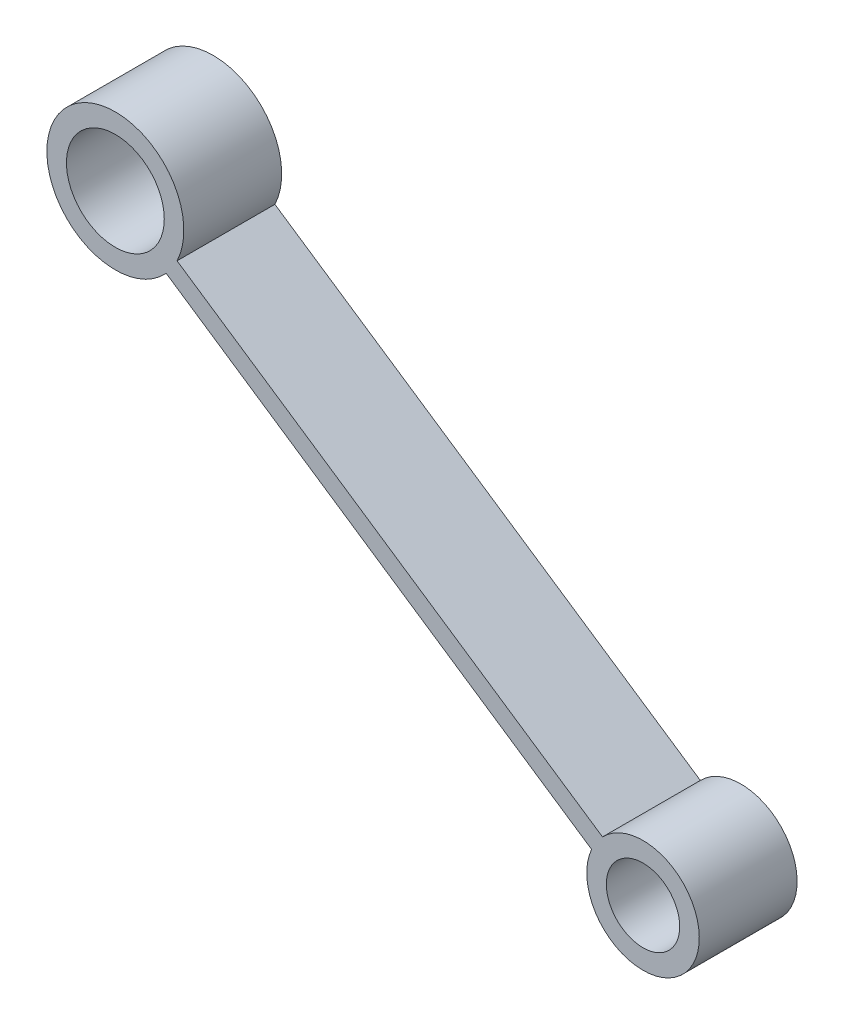
ISO-10303-21;
HEADER;
FILE_DESCRIPTION(('STEP AP214'),'2;1');
FILE_NAME('part.step','',(''),(''),'','','');
FILE_SCHEMA(('AUTOMOTIVE_DESIGN { 1 0 10303 214 1 1 1 1 }'));
ENDSEC;
DATA;
#1=APPLICATION_CONTEXT('core data for automotive mechanical design processes');
#2=APPLICATION_PROTOCOL_DEFINITION('international standard','automotive_design',2000,#1);
#3=PRODUCT_CONTEXT('',#1,'mechanical');
#4=PRODUCT('Part','Part','',(#3));
#5=PRODUCT_RELATED_PRODUCT_CATEGORY('part','',(#4));
#6=PRODUCT_DEFINITION_FORMATION('','',#4);
#7=PRODUCT_DEFINITION_CONTEXT('part definition',#1,'design');
#8=PRODUCT_DEFINITION('design','',#6,#7);
#9=PRODUCT_DEFINITION_SHAPE('','',#8);
#10=(LENGTH_UNIT() NAMED_UNIT(*) SI_UNIT(.MILLI.,.METRE.));
#11=(NAMED_UNIT(*) PLANE_ANGLE_UNIT() SI_UNIT($,.RADIAN.));
#12=(NAMED_UNIT(*) SI_UNIT($,.STERADIAN.) SOLID_ANGLE_UNIT());
#13=UNCERTAINTY_MEASURE_WITH_UNIT(LENGTH_MEASURE(1.E-05),#10,'distance_accuracy_value','');
#14=(GEOMETRIC_REPRESENTATION_CONTEXT(3) GLOBAL_UNCERTAINTY_ASSIGNED_CONTEXT((#13)) GLOBAL_UNIT_ASSIGNED_CONTEXT((#10,
#11,#12)) REPRESENTATION_CONTEXT('',''));
#15=CARTESIAN_POINT('',(0.,0.,0.));
#16=DIRECTION('',(0.,0.,1.));
#17=DIRECTION('',(1.,0.,0.));
#18=AXIS2_PLACEMENT_3D('',#15,#16,#17);
#19=CARTESIAN_POINT('',(0.,0.,10.));
#20=DIRECTION('',(0.,0.,-1.));
#21=DIRECTION('',(-1.,0.,0.));
#22=AXIS2_PLACEMENT_3D('',#19,#20,#21);
#23=CYLINDRICAL_SURFACE('',#22,5.);
#24=CARTESIAN_POINT('',(0.,0.,0.));
#25=DIRECTION('',(0.,0.,1.));
#26=DIRECTION('',(1.,0.,0.));
#27=AXIS2_PLACEMENT_3D('',#24,#25,#26);
#28=CIRCLE('',#27,5.);
#29=CARTESIAN_POINT('',(5.,0.,0.));
#30=VERTEX_POINT('',#29);
#31=EDGE_CURVE('E103',#30,#30,#28,.T.);
#32=ORIENTED_EDGE('',*,*,#31,.F.);
#33=EDGE_LOOP('',(#32));
#34=FACE_BOUND('',#33,.T.);
#35=CARTESIAN_POINT('',(0.,0.,10.));
#36=DIRECTION('',(0.,0.,1.));
#37=DIRECTION('',(1.,0.,0.));
#38=AXIS2_PLACEMENT_3D('',#35,#36,#37);
#39=CIRCLE('',#38,5.);
#40=CARTESIAN_POINT('',(5.,0.,10.));
#41=VERTEX_POINT('',#40);
#42=EDGE_CURVE('E96',#41,#41,#39,.T.);
#43=ORIENTED_EDGE('',*,*,#42,.T.);
#44=EDGE_LOOP('',(#43));
#45=FACE_BOUND('',#44,.T.);
#46=ADVANCED_FACE('F33',(#34,#45),#23,.F.);
#47=CARTESIAN_POINT('',(3.50677804688463,-3.56405776186189,10.));
#48=DIRECTION('',(0.558138712554013,0.829747658959366,0.));
#49=DIRECTION('',(-0.829747658959366,0.558138712554013,0.));
#50=AXIS2_PLACEMENT_3D('',#47,#48,#49);
#51=PLANE('',#50);
#52=DIRECTION('',(0.829747658959366,-0.558138712554013,0.));
#53=VECTOR('',#52,1.);
#54=CARTESIAN_POINT('',(3.50677804688463,-3.56405776186189,0.));
#55=LINE('',#54,#53);
#56=CARTESIAN_POINT('',(5.19052169856181,-4.69664609021789,0.));
#57=VERTEX_POINT('',#56);
#58=CARTESIAN_POINT('',(48.6771160336573,-33.9483728211967,0.));
#59=VERTEX_POINT('',#58);
#60=EDGE_CURVE('E36',#57,#59,#55,.T.);
#61=ORIENTED_EDGE('',*,*,#60,.T.);
#62=DIRECTION('',(0.,0.,1.));
#63=VECTOR('',#62,1.);
#64=CARTESIAN_POINT('',(48.6771160336573,-33.9483728211967,0.));
#65=LINE('',#64,#63);
#66=CARTESIAN_POINT('',(48.6771160336573,-33.9483728211967,10.));
#67=VERTEX_POINT('',#66);
#68=EDGE_CURVE('E75',#59,#67,#65,.T.);
#69=ORIENTED_EDGE('',*,*,#68,.T.);
#70=DIRECTION('',(0.829747658959366,-0.558138712554013,0.));
#71=VECTOR('',#70,1.);
#72=CARTESIAN_POINT('',(3.50677804688463,-3.56405776186189,10.));
#73=LINE('',#72,#71);
#74=CARTESIAN_POINT('',(5.19052169856181,-4.69664609021789,10.));
#75=VERTEX_POINT('',#74);
#76=EDGE_CURVE('E11',#75,#67,#73,.T.);
#77=ORIENTED_EDGE('',*,*,#76,.F.);
#78=DIRECTION('',(0.,0.,1.));
#79=VECTOR('',#78,1.);
#80=CARTESIAN_POINT('',(5.19052169856181,-4.69664609021789,0.));
#81=LINE('',#80,#79);
#82=EDGE_CURVE('E95',#75,#57,#81,.F.);
#83=ORIENTED_EDGE('',*,*,#82,.T.);
#84=EDGE_LOOP('',(#61,#69,#77,#83));
#85=FACE_BOUND('',#84,.T.);
#86=ADVANCED_FACE('F93',(#85),#51,.F.);
#87=CARTESIAN_POINT('',(53.9335978323588,-36.2790163160108,10.));
#88=DIRECTION('',(0.,0.,-1.));
#89=DIRECTION('',(-1.,0.,0.));
#90=AXIS2_PLACEMENT_3D('',#87,#88,#89);
#91=CYLINDRICAL_SURFACE('',#90,3.75);
#92=CARTESIAN_POINT('',(53.9335978323588,-36.2790163160108,0.));
#93=DIRECTION('',(0.,0.,1.));
#94=DIRECTION('',(1.,0.,0.));
#95=AXIS2_PLACEMENT_3D('',#92,#93,#94);
#96=CIRCLE('',#95,3.75);
#97=CARTESIAN_POINT('',(57.6835978323588,-36.2790163160108,0.));
#98=VERTEX_POINT('',#97);
#99=EDGE_CURVE('E97',#98,#98,#96,.T.);
#100=ORIENTED_EDGE('',*,*,#99,.F.);
#101=EDGE_LOOP('',(#100));
#102=FACE_BOUND('',#101,.T.);
#103=CARTESIAN_POINT('',(53.9335978323588,-36.2790163160108,10.));
#104=DIRECTION('',(0.,0.,1.));
#105=DIRECTION('',(1.,0.,0.));
#106=AXIS2_PLACEMENT_3D('',#103,#104,#105);
#107=CIRCLE('',#106,3.75);
#108=CARTESIAN_POINT('',(57.6835978323588,-36.2790163160108,10.));
#109=VERTEX_POINT('',#108);
#110=EDGE_CURVE('E41',#109,#109,#107,.T.);
#111=ORIENTED_EDGE('',*,*,#110,.T.);
#112=EDGE_LOOP('',(#111));
#113=FACE_BOUND('',#112,.T.);
#114=ADVANCED_FACE('F126',(#102,#113),#91,.F.);
#115=CARTESIAN_POINT('',(4.62305547199266,-1.90456244394316,10.));
#116=DIRECTION('',(0.558138712554013,0.829747658959366,0.));
#117=DIRECTION('',(-0.829747658959366,0.558138712554013,0.));
#118=AXIS2_PLACEMENT_3D('',#115,#116,#117);
#119=PLANE('',#118);
#120=DIRECTION('',(0.,0.,1.));
#121=VECTOR('',#120,1.);
#122=CARTESIAN_POINT('',(49.7933934587653,-32.288877503278,0.));
#123=LINE('',#122,#121);
#124=CARTESIAN_POINT('',(49.7933934587653,-32.288877503278,0.));
#125=VERTEX_POINT('',#124);
#126=CARTESIAN_POINT('',(49.7933934587653,-32.288877503278,10.));
#127=VERTEX_POINT('',#126);
#128=EDGE_CURVE('E53',#125,#127,#123,.T.);
#129=ORIENTED_EDGE('',*,*,#128,.F.);
#130=DIRECTION('',(0.829747658959366,-0.558138712554013,0.));
#131=VECTOR('',#130,1.);
#132=CARTESIAN_POINT('',(4.62305547199266,-1.90456244394316,0.));
#133=LINE('',#132,#131);
#134=CARTESIAN_POINT('',(6.30679912366984,-3.03715077229916,0.));
#135=VERTEX_POINT('',#134);
#136=EDGE_CURVE('E91',#135,#125,#133,.T.);
#137=ORIENTED_EDGE('',*,*,#136,.F.);
#138=DIRECTION('',(0.,0.,1.));
#139=VECTOR('',#138,1.);
#140=CARTESIAN_POINT('',(6.30679912366984,-3.03715077229916,0.));
#141=LINE('',#140,#139);
#142=CARTESIAN_POINT('',(6.30679912366984,-3.03715077229916,10.));
#143=VERTEX_POINT('',#142);
#144=EDGE_CURVE('E112',#143,#135,#141,.F.);
#145=ORIENTED_EDGE('',*,*,#144,.F.);
#146=DIRECTION('',(0.829747658959366,-0.558138712554013,0.));
#147=VECTOR('',#146,1.);
#148=CARTESIAN_POINT('',(4.62305547199266,-1.90456244394316,10.));
#149=LINE('',#148,#147);
#150=EDGE_CURVE('E49',#143,#127,#149,.T.);
#151=ORIENTED_EDGE('',*,*,#150,.T.);
#152=EDGE_LOOP('',(#129,#137,#145,#151));
#153=FACE_BOUND('',#152,.T.);
#154=ADVANCED_FACE('F124',(#153),#119,.T.);
#155=CARTESIAN_POINT('',(0.,0.,10.));
#156=DIRECTION('',(0.,0.,1.));
#157=DIRECTION('',(1.,0.,0.));
#158=AXIS2_PLACEMENT_3D('',#155,#156,#157);
#159=PLANE('',#158);
#160=ORIENTED_EDGE('',*,*,#110,.F.);
#161=EDGE_LOOP('',(#160));
#162=FACE_BOUND('',#161,.T.);
#163=ORIENTED_EDGE('',*,*,#76,.T.);
#164=CARTESIAN_POINT('',(53.9335978323588,-36.2790163160108,10.));
#165=DIRECTION('',(0.,0.,1.));
#166=DIRECTION('',(1.,0.,0.));
#167=AXIS2_PLACEMENT_3D('',#164,#165,#166);
#168=CIRCLE('',#167,5.74999999999999);
#169=EDGE_CURVE('E80',#67,#127,#168,.T.);
#170=ORIENTED_EDGE('',*,*,#169,.T.);
#171=ORIENTED_EDGE('',*,*,#150,.F.);
#172=CARTESIAN_POINT('',(0.,0.,10.));
#173=DIRECTION('',(0.,0.,1.));
#174=DIRECTION('',(1.,0.,0.));
#175=AXIS2_PLACEMENT_3D('',#172,#173,#174);
#176=CIRCLE('',#175,7.);
#177=EDGE_CURVE('E83',#143,#75,#176,.T.);
#178=ORIENTED_EDGE('',*,*,#177,.T.);
#179=EDGE_LOOP('',(#163,#170,#171,#178));
#180=FACE_BOUND('',#179,.T.);
#181=ORIENTED_EDGE('',*,*,#42,.F.);
#182=EDGE_LOOP('',(#181));
#183=FACE_BOUND('',#182,.T.);
#184=ADVANCED_FACE('F120',(#162,#180,#183),#159,.T.);
#185=CARTESIAN_POINT('',(0.,0.,0.));
#186=DIRECTION('',(0.,0.,1.));
#187=DIRECTION('',(1.,0.,0.));
#188=AXIS2_PLACEMENT_3D('',#185,#186,#187);
#189=PLANE('',#188);
#190=ORIENTED_EDGE('',*,*,#99,.T.);
#191=EDGE_LOOP('',(#190));
#192=FACE_BOUND('',#191,.T.);
#193=ORIENTED_EDGE('',*,*,#136,.T.);
#194=CARTESIAN_POINT('',(53.9335978323588,-36.2790163160108,0.));
#195=DIRECTION('',(0.,0.,1.));
#196=DIRECTION('',(1.,0.,0.));
#197=AXIS2_PLACEMENT_3D('',#194,#195,#196);
#198=CIRCLE('',#197,5.74999999999999);
#199=EDGE_CURVE('E78',#59,#125,#198,.T.);
#200=ORIENTED_EDGE('',*,*,#199,.F.);
#201=ORIENTED_EDGE('',*,*,#60,.F.);
#202=CARTESIAN_POINT('',(0.,0.,0.));
#203=DIRECTION('',(0.,0.,1.));
#204=DIRECTION('',(1.,0.,0.));
#205=AXIS2_PLACEMENT_3D('',#202,#203,#204);
#206=CIRCLE('',#205,7.);
#207=EDGE_CURVE('E114',#135,#57,#206,.T.);
#208=ORIENTED_EDGE('',*,*,#207,.F.);
#209=EDGE_LOOP('',(#193,#200,#201,#208));
#210=FACE_BOUND('',#209,.T.);
#211=ORIENTED_EDGE('',*,*,#31,.T.);
#212=EDGE_LOOP('',(#211));
#213=FACE_BOUND('',#212,.T.);
#214=ADVANCED_FACE('F87',(#192,#210,#213),#189,.F.);
#215=CARTESIAN_POINT('',(0.,0.,0.));
#216=DIRECTION('',(0.,0.,1.));
#217=DIRECTION('',(1.,0.,0.));
#218=AXIS2_PLACEMENT_3D('',#215,#216,#217);
#219=CYLINDRICAL_SURFACE('',#218,7.);
#220=ORIENTED_EDGE('',*,*,#82,.F.);
#221=ORIENTED_EDGE('',*,*,#177,.F.);
#222=ORIENTED_EDGE('',*,*,#144,.T.);
#223=ORIENTED_EDGE('',*,*,#207,.T.);
#224=EDGE_LOOP('',(#220,#221,#222,#223));
#225=FACE_BOUND('',#224,.T.);
#226=ADVANCED_FACE('F123',(#225),#219,.T.);
#227=CARTESIAN_POINT('',(53.9335978323588,-36.2790163160108,0.));
#228=DIRECTION('',(0.,0.,1.));
#229=DIRECTION('',(1.,0.,0.));
#230=AXIS2_PLACEMENT_3D('',#227,#228,#229);
#231=CYLINDRICAL_SURFACE('',#230,5.74999999999999);
#232=ORIENTED_EDGE('',*,*,#68,.F.);
#233=ORIENTED_EDGE('',*,*,#199,.T.);
#234=ORIENTED_EDGE('',*,*,#128,.T.);
#235=ORIENTED_EDGE('',*,*,#169,.F.);
#236=EDGE_LOOP('',(#232,#233,#234,#235));
#237=FACE_BOUND('',#236,.T.);
#238=ADVANCED_FACE('F77',(#237),#231,.T.);
#239=CLOSED_SHELL('',(#46,#86,#114,#154,#184,#214,#226,#238));
#240=MANIFOLD_SOLID_BREP('B2',#239);
#241=ADVANCED_BREP_SHAPE_REPRESENTATION('',(#18,#240),#14);
#242=SHAPE_DEFINITION_REPRESENTATION(#9,#241);
ENDSEC;
END-ISO-10303-21;
